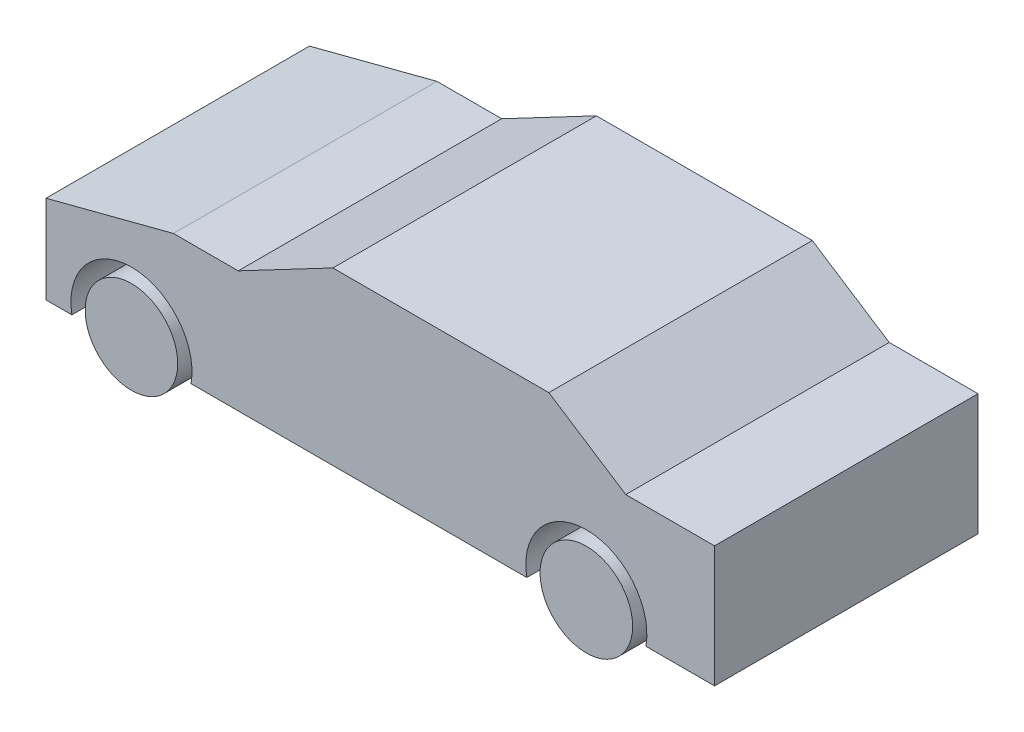
ISO-10303-21;
HEADER;
FILE_DESCRIPTION(('STEP AP214'),'2;1');
FILE_NAME('part.step','',(''),(''),'','','');
FILE_SCHEMA(('AUTOMOTIVE_DESIGN { 1 0 10303 214 1 1 1 1 }'));
ENDSEC;
DATA;
#1=APPLICATION_CONTEXT('core data for automotive mechanical design processes');
#2=APPLICATION_PROTOCOL_DEFINITION('international standard','automotive_design',2000,#1);
#3=PRODUCT_CONTEXT('',#1,'mechanical');
#4=PRODUCT('Part','Part','',(#3));
#5=PRODUCT_RELATED_PRODUCT_CATEGORY('part','',(#4));
#6=PRODUCT_DEFINITION_FORMATION('','',#4);
#7=PRODUCT_DEFINITION_CONTEXT('part definition',#1,'design');
#8=PRODUCT_DEFINITION('design','',#6,#7);
#9=PRODUCT_DEFINITION_SHAPE('','',#8);
#10=(LENGTH_UNIT() NAMED_UNIT(*) SI_UNIT(.MILLI.,.METRE.));
#11=(NAMED_UNIT(*) PLANE_ANGLE_UNIT() SI_UNIT($,.RADIAN.));
#12=(NAMED_UNIT(*) SI_UNIT($,.STERADIAN.) SOLID_ANGLE_UNIT());
#13=UNCERTAINTY_MEASURE_WITH_UNIT(LENGTH_MEASURE(1.E-05),#10,'distance_accuracy_value','');
#14=(GEOMETRIC_REPRESENTATION_CONTEXT(3) GLOBAL_UNCERTAINTY_ASSIGNED_CONTEXT((#13)) GLOBAL_UNIT_ASSIGNED_CONTEXT((#10,
#11,#12)) REPRESENTATION_CONTEXT('',''));
#15=CARTESIAN_POINT('',(0.,0.,0.));
#16=DIRECTION('',(0.,0.,1.));
#17=DIRECTION('',(1.,0.,0.));
#18=AXIS2_PLACEMENT_3D('',#15,#16,#17);
#19=CARTESIAN_POINT('',(3794.,-1118.,1850.));
#20=DIRECTION('',(0.,0.,-1.));
#21=DIRECTION('',(-1.,0.,0.));
#22=AXIS2_PLACEMENT_3D('',#19,#20,#21);
#23=CYLINDRICAL_SURFACE('',#22,325.000000000001);
#24=CARTESIAN_POINT('',(3794.,-1118.,1850.));
#25=DIRECTION('',(0.,0.,1.));
#26=DIRECTION('',(1.,0.,0.));
#27=AXIS2_PLACEMENT_3D('',#24,#25,#26);
#28=CIRCLE('',#27,325.000000000001);
#29=CARTESIAN_POINT('',(4119.,-1118.,1850.));
#30=VERTEX_POINT('',#29);
#31=EDGE_CURVE('E12',#30,#30,#28,.T.);
#32=ORIENTED_EDGE('',*,*,#31,.F.);
#33=EDGE_LOOP('',(#32));
#34=FACE_BOUND('',#33,.T.);
#35=CARTESIAN_POINT('',(3794.,-1118.,0.));
#36=DIRECTION('',(0.,0.,1.));
#37=DIRECTION('',(1.,0.,0.));
#38=AXIS2_PLACEMENT_3D('',#35,#36,#37);
#39=CIRCLE('',#38,325.000000000001);
#40=CARTESIAN_POINT('',(4119.,-1118.,0.));
#41=VERTEX_POINT('',#40);
#42=EDGE_CURVE('E135',#41,#41,#39,.T.);
#43=ORIENTED_EDGE('',*,*,#42,.T.);
#44=EDGE_LOOP('',(#43));
#45=FACE_BOUND('',#44,.T.);
#46=ADVANCED_FACE('F132',(#34,#45),#23,.T.);
#47=CARTESIAN_POINT('',(0.,0.,1850.));
#48=DIRECTION('',(0.,0.,1.));
#49=DIRECTION('',(1.,0.,0.));
#50=AXIS2_PLACEMENT_3D('',#47,#48,#49);
#51=PLANE('',#50);
#52=ORIENTED_EDGE('',*,*,#31,.T.);
#53=EDGE_LOOP('',(#52));
#54=FACE_BOUND('',#53,.T.);
#55=ADVANCED_FACE('F147',(#54),#51,.T.);
#56=CARTESIAN_POINT('',(0.,0.,0.));
#57=DIRECTION('',(0.,0.,1.));
#58=DIRECTION('',(1.,0.,0.));
#59=AXIS2_PLACEMENT_3D('',#56,#57,#58);
#60=PLANE('',#59);
#61=ORIENTED_EDGE('',*,*,#42,.F.);
#62=EDGE_LOOP('',(#61));
#63=FACE_BOUND('',#62,.T.);
#64=ADVANCED_FACE('F145',(#63),#60,.F.);
#65=CLOSED_SHELL('',(#46,#55,#64));
#66=MANIFOLD_SOLID_BREP('B2',#65);
#67=CARTESIAN_POINT('',(600.,-1118.,1850.));
#68=DIRECTION('',(0.,0.,-1.));
#69=DIRECTION('',(-1.,0.,0.));
#70=AXIS2_PLACEMENT_3D('',#67,#68,#69);
#71=CYLINDRICAL_SURFACE('',#70,325.);
#72=CARTESIAN_POINT('',(600.,-1118.,1850.));
#73=DIRECTION('',(0.,0.,1.));
#74=DIRECTION('',(1.,0.,0.));
#75=AXIS2_PLACEMENT_3D('',#72,#73,#74);
#76=CIRCLE('',#75,325.);
#77=CARTESIAN_POINT('',(925.,-1118.,1850.));
#78=VERTEX_POINT('',#77);
#79=EDGE_CURVE('E131',#78,#78,#76,.T.);
#80=ORIENTED_EDGE('',*,*,#79,.F.);
#81=EDGE_LOOP('',(#80));
#82=FACE_BOUND('',#81,.T.);
#83=CARTESIAN_POINT('',(600.,-1118.,0.));
#84=DIRECTION('',(0.,0.,1.));
#85=DIRECTION('',(1.,0.,0.));
#86=AXIS2_PLACEMENT_3D('',#83,#84,#85);
#87=CIRCLE('',#86,325.);
#88=CARTESIAN_POINT('',(925.,-1118.,0.));
#89=VERTEX_POINT('',#88);
#90=EDGE_CURVE('E185',#89,#89,#87,.T.);
#91=ORIENTED_EDGE('',*,*,#90,.T.);
#92=EDGE_LOOP('',(#91));
#93=FACE_BOUND('',#92,.T.);
#94=ADVANCED_FACE('F182',(#82,#93),#71,.T.);
#95=CARTESIAN_POINT('',(0.,0.,1850.));
#96=DIRECTION('',(0.,0.,1.));
#97=DIRECTION('',(1.,0.,0.));
#98=AXIS2_PLACEMENT_3D('',#95,#96,#97);
#99=PLANE('',#98);
#100=ORIENTED_EDGE('',*,*,#79,.T.);
#101=EDGE_LOOP('',(#100));
#102=FACE_BOUND('',#101,.T.);
#103=ADVANCED_FACE('F197',(#102),#99,.T.);
#104=CARTESIAN_POINT('',(0.,0.,0.));
#105=DIRECTION('',(0.,0.,1.));
#106=DIRECTION('',(1.,0.,0.));
#107=AXIS2_PLACEMENT_3D('',#104,#105,#106);
#108=PLANE('',#107);
#109=ORIENTED_EDGE('',*,*,#90,.F.);
#110=EDGE_LOOP('',(#109));
#111=FACE_BOUND('',#110,.T.);
#112=ADVANCED_FACE('F195',(#111),#108,.F.);
#113=CLOSED_SHELL('',(#94,#103,#112));
#114=MANIFOLD_SOLID_BREP('B7',#113);
#115=CARTESIAN_POINT('',(3794.,-1118.,1850.));
#116=DIRECTION('',(0.,0.,-1.));
#117=DIRECTION('',(-1.,0.,0.));
#118=AXIS2_PLACEMENT_3D('',#115,#116,#117);
#119=CYLINDRICAL_SURFACE('',#118,425.);
#120=CARTESIAN_POINT('',(3794.,-1118.,0.));
#121=DIRECTION('',(0.,0.,1.));
#122=DIRECTION('',(1.,0.,0.));
#123=AXIS2_PLACEMENT_3D('',#120,#121,#122);
#124=CIRCLE('',#123,425.);
#125=CARTESIAN_POINT('',(4212.33001326704,-1193.,0.));
#126=VERTEX_POINT('',#125);
#127=CARTESIAN_POINT('',(3375.66998673296,-1193.,0.));
#128=VERTEX_POINT('',#127);
#129=EDGE_CURVE('E353',#126,#128,#124,.T.);
#130=ORIENTED_EDGE('',*,*,#129,.F.);
#131=DIRECTION('',(0.,0.,-1.));
#132=VECTOR('',#131,1.);
#133=CARTESIAN_POINT('',(4212.33001326704,-1193.,1850.));
#134=LINE('',#133,#132);
#135=CARTESIAN_POINT('',(4212.33001326704,-1193.,1850.));
#136=VERTEX_POINT('',#135);
#137=EDGE_CURVE('E180',#136,#126,#134,.T.);
#138=ORIENTED_EDGE('',*,*,#137,.F.);
#139=CARTESIAN_POINT('',(3794.,-1118.,1850.));
#140=DIRECTION('',(0.,0.,1.));
#141=DIRECTION('',(1.,0.,0.));
#142=AXIS2_PLACEMENT_3D('',#139,#140,#141);
#143=CIRCLE('',#142,425.);
#144=CARTESIAN_POINT('',(3375.66998673296,-1193.,1850.));
#145=VERTEX_POINT('',#144);
#146=EDGE_CURVE('E400',#136,#145,#143,.T.);
#147=ORIENTED_EDGE('',*,*,#146,.T.);
#148=DIRECTION('',(0.,0.,-1.));
#149=VECTOR('',#148,1.);
#150=CARTESIAN_POINT('',(3375.66998673296,-1193.,1850.));
#151=LINE('',#150,#149);
#152=EDGE_CURVE('E289',#145,#128,#151,.T.);
#153=ORIENTED_EDGE('',*,*,#152,.T.);
#154=EDGE_LOOP('',(#130,#138,#147,#153));
#155=FACE_BOUND('',#154,.T.);
#156=ADVANCED_FACE('F223',(#155),#119,.F.);
#157=CARTESIAN_POINT('',(0.,-1193.,1850.));
#158=DIRECTION('',(0.,1.,0.));
#159=DIRECTION('',(0.,0.,1.));
#160=AXIS2_PLACEMENT_3D('',#157,#158,#159);
#161=PLANE('',#160);
#162=DIRECTION('',(1.,0.,0.));
#163=VECTOR('',#162,1.);
#164=CARTESIAN_POINT('',(0.,-1193.,0.));
#165=LINE('',#164,#163);
#166=CARTESIAN_POINT('',(4694.,-1193.,0.));
#167=VERTEX_POINT('',#166);
#168=EDGE_CURVE('E357',#126,#167,#165,.T.);
#169=ORIENTED_EDGE('',*,*,#168,.T.);
#170=DIRECTION('',(0.,0.,-1.));
#171=VECTOR('',#170,1.);
#172=CARTESIAN_POINT('',(4694.,-1193.,1850.));
#173=LINE('',#172,#171);
#174=CARTESIAN_POINT('',(4694.,-1193.,1850.));
#175=VERTEX_POINT('',#174);
#176=EDGE_CURVE('E232',#175,#167,#173,.T.);
#177=ORIENTED_EDGE('',*,*,#176,.F.);
#178=DIRECTION('',(1.,0.,0.));
#179=VECTOR('',#178,1.);
#180=CARTESIAN_POINT('',(0.,-1193.,1850.));
#181=LINE('',#180,#179);
#182=EDGE_CURVE('E449',#136,#175,#181,.T.);
#183=ORIENTED_EDGE('',*,*,#182,.F.);
#184=ORIENTED_EDGE('',*,*,#137,.T.);
#185=EDGE_LOOP('',(#169,#177,#183,#184));
#186=FACE_BOUND('',#185,.T.);
#187=ADVANCED_FACE('F437',(#186),#161,.F.);
#188=CARTESIAN_POINT('',(4694.,0.,1850.));
#189=DIRECTION('',(1.,0.,0.));
#190=DIRECTION('',(0.,0.,-1.));
#191=AXIS2_PLACEMENT_3D('',#188,#189,#190);
#192=PLANE('',#191);
#193=DIRECTION('',(0.,-1.,0.));
#194=VECTOR('',#193,1.);
#195=CARTESIAN_POINT('',(4694.,0.,0.));
#196=LINE('',#195,#194);
#197=CARTESIAN_POINT('',(4694.,-341.186371334687,0.));
#198=VERTEX_POINT('',#197);
#199=EDGE_CURVE('E361',#198,#167,#196,.T.);
#200=ORIENTED_EDGE('',*,*,#199,.F.);
#201=DIRECTION('',(0.,0.,-1.));
#202=VECTOR('',#201,1.);
#203=CARTESIAN_POINT('',(4694.,-341.186371334687,1850.));
#204=LINE('',#203,#202);
#205=CARTESIAN_POINT('',(4694.,-341.186371334687,1850.));
#206=VERTEX_POINT('',#205);
#207=EDGE_CURVE('E425',#206,#198,#204,.T.);
#208=ORIENTED_EDGE('',*,*,#207,.F.);
#209=DIRECTION('',(0.,-1.,0.));
#210=VECTOR('',#209,1.);
#211=CARTESIAN_POINT('',(4694.,0.,1850.));
#212=LINE('',#211,#210);
#213=EDGE_CURVE('E434',#206,#175,#212,.T.);
#214=ORIENTED_EDGE('',*,*,#213,.T.);
#215=ORIENTED_EDGE('',*,*,#176,.T.);
#216=EDGE_LOOP('',(#200,#208,#214,#215));
#217=FACE_BOUND('',#216,.T.);
#218=ADVANCED_FACE('F432',(#217),#192,.T.);
#219=CARTESIAN_POINT('',(0.,-341.186371334687,1850.));
#220=DIRECTION('',(0.,1.,0.));
#221=DIRECTION('',(0.,0.,1.));
#222=AXIS2_PLACEMENT_3D('',#219,#220,#221);
#223=PLANE('',#222);
#224=DIRECTION('',(1.,0.,0.));
#225=VECTOR('',#224,1.);
#226=CARTESIAN_POINT('',(0.,-341.186371334687,0.));
#227=LINE('',#226,#225);
#228=CARTESIAN_POINT('',(4070.67038106034,-341.186371334687,0.));
#229=VERTEX_POINT('',#228);
#230=EDGE_CURVE('E365',#229,#198,#227,.T.);
#231=ORIENTED_EDGE('',*,*,#230,.F.);
#232=DIRECTION('',(0.,0.,-1.));
#233=VECTOR('',#232,1.);
#234=CARTESIAN_POINT('',(4070.67038106034,-341.186371334687,1850.));
#235=LINE('',#234,#233);
#236=CARTESIAN_POINT('',(4070.67038106034,-341.186371334687,1850.));
#237=VERTEX_POINT('',#236);
#238=EDGE_CURVE('E422',#237,#229,#235,.T.);
#239=ORIENTED_EDGE('',*,*,#238,.F.);
#240=DIRECTION('',(1.,0.,0.));
#241=VECTOR('',#240,1.);
#242=CARTESIAN_POINT('',(0.,-341.186371334687,1850.));
#243=LINE('',#242,#241);
#244=EDGE_CURVE('E446',#237,#206,#243,.T.);
#245=ORIENTED_EDGE('',*,*,#244,.T.);
#246=ORIENTED_EDGE('',*,*,#207,.T.);
#247=EDGE_LOOP('',(#231,#239,#245,#246));
#248=FACE_BOUND('',#247,.T.);
#249=ADVANCED_FACE('F443',(#248),#223,.T.);
#250=CARTESIAN_POINT('',(1048.40561075343,1617.60741196378,1850.));
#251=DIRECTION('',(0.543879513064902,0.839163318590777,0.));
#252=DIRECTION('',(-0.839163318590777,0.543879513064902,0.));
#253=AXIS2_PLACEMENT_3D('',#250,#251,#252);
#254=PLANE('',#253);
#255=DIRECTION('',(0.839163318590777,-0.543879513064902,0.));
#256=VECTOR('',#255,1.);
#257=CARTESIAN_POINT('',(1048.40561075343,1617.60741196378,0.));
#258=LINE('',#257,#256);
#259=CARTESIAN_POINT('',(3530.64790466358,8.81362866531277,0.));
#260=VERTEX_POINT('',#259);
#261=EDGE_CURVE('E369',#260,#229,#258,.T.);
#262=ORIENTED_EDGE('',*,*,#261,.F.);
#263=DIRECTION('',(0.,0.,-1.));
#264=VECTOR('',#263,1.);
#265=CARTESIAN_POINT('',(3530.64790466358,8.81362866531277,1850.));
#266=LINE('',#265,#264);
#267=CARTESIAN_POINT('',(3530.64790466358,8.81362866531277,1850.));
#268=VERTEX_POINT('',#267);
#269=EDGE_CURVE('E419',#268,#260,#266,.T.);
#270=ORIENTED_EDGE('',*,*,#269,.F.);
#271=DIRECTION('',(0.839163318590777,-0.543879513064902,0.));
#272=VECTOR('',#271,1.);
#273=CARTESIAN_POINT('',(1048.40561075343,1617.60741196378,1850.));
#274=LINE('',#273,#272);
#275=EDGE_CURVE('E454',#268,#237,#274,.T.);
#276=ORIENTED_EDGE('',*,*,#275,.T.);
#277=ORIENTED_EDGE('',*,*,#238,.T.);
#278=EDGE_LOOP('',(#262,#270,#276,#277));
#279=FACE_BOUND('',#278,.T.);
#280=ADVANCED_FACE('F575',(#279),#254,.T.);
#281=CARTESIAN_POINT('',(0.,8.81362866531277,1850.));
#282=DIRECTION('',(0.,1.,0.));
#283=DIRECTION('',(0.,0.,1.));
#284=AXIS2_PLACEMENT_3D('',#281,#282,#283);
#285=PLANE('',#284);
#286=DIRECTION('',(1.,0.,0.));
#287=VECTOR('',#286,1.);
#288=CARTESIAN_POINT('',(0.,8.81362866531277,0.));
#289=LINE('',#288,#287);
#290=CARTESIAN_POINT('',(2014.43095170345,8.81362866531277,0.));
#291=VERTEX_POINT('',#290);
#292=EDGE_CURVE('E373',#291,#260,#289,.T.);
#293=ORIENTED_EDGE('',*,*,#292,.F.);
#294=DIRECTION('',(0.,0.,-1.));
#295=VECTOR('',#294,1.);
#296=CARTESIAN_POINT('',(2014.43095170345,8.81362866531277,1850.));
#297=LINE('',#296,#295);
#298=CARTESIAN_POINT('',(2014.43095170345,8.81362866531277,1850.));
#299=VERTEX_POINT('',#298);
#300=EDGE_CURVE('E416',#299,#291,#297,.T.);
#301=ORIENTED_EDGE('',*,*,#300,.F.);
#302=DIRECTION('',(1.,0.,0.));
#303=VECTOR('',#302,1.);
#304=CARTESIAN_POINT('',(0.,8.81362866531277,1850.));
#305=LINE('',#304,#303);
#306=EDGE_CURVE('E461',#299,#268,#305,.T.);
#307=ORIENTED_EDGE('',*,*,#306,.T.);
#308=ORIENTED_EDGE('',*,*,#269,.T.);
#309=EDGE_LOOP('',(#293,#301,#307,#308));
#310=FACE_BOUND('',#309,.T.);
#311=ADVANCED_FACE('F565',(#310),#285,.T.);
#312=CARTESIAN_POINT('',(433.703775540426,-823.594854997678,1850.));
#313=DIRECTION('',(-0.465942272843301,0.884815121015469,0.));
#314=DIRECTION('',(-0.884815121015469,-0.465942272843301,0.));
#315=AXIS2_PLACEMENT_3D('',#312,#313,#314);
#316=PLANE('',#315);
#317=DIRECTION('',(0.884815121015469,0.465942272843301,0.));
#318=VECTOR('',#317,1.);
#319=CARTESIAN_POINT('',(433.703775540426,-823.594854997678,0.));
#320=LINE('',#319,#318);
#321=CARTESIAN_POINT('',(1349.78790383051,-341.186371334687,0.));
#322=VERTEX_POINT('',#321);
#323=EDGE_CURVE('E377',#322,#291,#320,.T.);
#324=ORIENTED_EDGE('',*,*,#323,.F.);
#325=DIRECTION('',(0.,0.,-1.));
#326=VECTOR('',#325,1.);
#327=CARTESIAN_POINT('',(1349.78790383051,-341.186371334687,1850.));
#328=LINE('',#327,#326);
#329=CARTESIAN_POINT('',(1349.78790383051,-341.186371334687,1850.));
#330=VERTEX_POINT('',#329);
#331=EDGE_CURVE('E413',#330,#322,#328,.T.);
#332=ORIENTED_EDGE('',*,*,#331,.F.);
#333=DIRECTION('',(0.884815121015469,0.465942272843301,0.));
#334=VECTOR('',#333,1.);
#335=CARTESIAN_POINT('',(433.703775540426,-823.594854997678,1850.));
#336=LINE('',#335,#334);
#337=EDGE_CURVE('E465',#330,#299,#336,.T.);
#338=ORIENTED_EDGE('',*,*,#337,.T.);
#339=ORIENTED_EDGE('',*,*,#300,.T.);
#340=EDGE_LOOP('',(#324,#332,#338,#339));
#341=FACE_BOUND('',#340,.T.);
#342=ADVANCED_FACE('F556',(#341),#316,.T.);
#343=CARTESIAN_POINT('',(0.,-341.186371334687,1850.));
#344=DIRECTION('',(0.,1.,0.));
#345=DIRECTION('',(0.,0.,1.));
#346=AXIS2_PLACEMENT_3D('',#343,#344,#345);
#347=PLANE('',#346);
#348=DIRECTION('',(1.,0.,0.));
#349=VECTOR('',#348,1.);
#350=CARTESIAN_POINT('',(0.,-341.186371334687,0.));
#351=LINE('',#350,#349);
#352=CARTESIAN_POINT('',(895.308793072895,-341.186371334687,0.));
#353=VERTEX_POINT('',#352);
#354=EDGE_CURVE('E381',#353,#322,#351,.T.);
#355=ORIENTED_EDGE('',*,*,#354,.F.);
#356=DIRECTION('',(0.,0.,-1.));
#357=VECTOR('',#356,1.);
#358=CARTESIAN_POINT('',(895.308793072895,-341.186371334687,1850.));
#359=LINE('',#358,#357);
#360=CARTESIAN_POINT('',(895.308793072895,-341.186371334687,1850.));
#361=VERTEX_POINT('',#360);
#362=EDGE_CURVE('E410',#361,#353,#359,.T.);
#363=ORIENTED_EDGE('',*,*,#362,.F.);
#364=DIRECTION('',(1.,0.,0.));
#365=VECTOR('',#364,1.);
#366=CARTESIAN_POINT('',(0.,-341.186371334687,1850.));
#367=LINE('',#366,#365);
#368=EDGE_CURVE('E469',#361,#330,#367,.T.);
#369=ORIENTED_EDGE('',*,*,#368,.T.);
#370=ORIENTED_EDGE('',*,*,#331,.T.);
#371=EDGE_LOOP('',(#355,#363,#369,#370));
#372=FACE_BOUND('',#371,.T.);
#373=ADVANCED_FACE('F485',(#372),#347,.T.);
#374=CARTESIAN_POINT('',(140.038708716138,-537.838447503874,1850.));
#375=DIRECTION('',(-0.251972111424384,0.967734496163249,0.));
#376=DIRECTION('',(-0.967734496163249,-0.251972111424384,0.));
#377=AXIS2_PLACEMENT_3D('',#374,#375,#376);
#378=PLANE('',#377);
#379=DIRECTION('',(0.967734496163249,0.251972111424384,0.));
#380=VECTOR('',#379,1.);
#381=CARTESIAN_POINT('',(140.038708716138,-537.838447503874,0.));
#382=LINE('',#381,#380);
#383=CARTESIAN_POINT('',(0.,-574.30077188752,0.));
#384=VERTEX_POINT('',#383);
#385=EDGE_CURVE('E385',#384,#353,#382,.T.);
#386=ORIENTED_EDGE('',*,*,#385,.F.);
#387=DIRECTION('',(0.,0.,-1.));
#388=VECTOR('',#387,1.);
#389=CARTESIAN_POINT('',(0.,-574.30077188752,1850.));
#390=LINE('',#389,#388);
#391=CARTESIAN_POINT('',(0.,-574.30077188752,1850.));
#392=VERTEX_POINT('',#391);
#393=EDGE_CURVE('E407',#392,#384,#390,.T.);
#394=ORIENTED_EDGE('',*,*,#393,.F.);
#395=DIRECTION('',(0.967734496163249,0.251972111424384,0.));
#396=VECTOR('',#395,1.);
#397=CARTESIAN_POINT('',(140.038708716138,-537.838447503874,1850.));
#398=LINE('',#397,#396);
#399=EDGE_CURVE('E473',#392,#361,#398,.T.);
#400=ORIENTED_EDGE('',*,*,#399,.T.);
#401=ORIENTED_EDGE('',*,*,#362,.T.);
#402=EDGE_LOOP('',(#386,#394,#400,#401));
#403=FACE_BOUND('',#402,.T.);
#404=ADVANCED_FACE('F479',(#403),#378,.T.);
#405=CARTESIAN_POINT('',(0.,0.,1850.));
#406=DIRECTION('',(1.,0.,0.));
#407=DIRECTION('',(0.,1.,0.));
#408=AXIS2_PLACEMENT_3D('',#405,#406,#407);
#409=PLANE('',#408);
#410=DIRECTION('',(0.,-1.,0.));
#411=VECTOR('',#410,1.);
#412=CARTESIAN_POINT('',(0.,0.,0.));
#413=LINE('',#412,#411);
#414=CARTESIAN_POINT('',(2.80976767184496E-13,-1193.,0.));
#415=VERTEX_POINT('',#414);
#416=EDGE_CURVE('E389',#384,#415,#413,.T.);
#417=ORIENTED_EDGE('',*,*,#416,.T.);
#418=DIRECTION('',(0.,0.,-1.));
#419=VECTOR('',#418,1.);
#420=CARTESIAN_POINT('',(2.80976767184496E-13,-1193.,1850.));
#421=LINE('',#420,#419);
#422=CARTESIAN_POINT('',(2.80976767184496E-13,-1193.,1850.));
#423=VERTEX_POINT('',#422);
#424=EDGE_CURVE('E344',#423,#415,#421,.T.);
#425=ORIENTED_EDGE('',*,*,#424,.F.);
#426=DIRECTION('',(0.,-1.,0.));
#427=VECTOR('',#426,1.);
#428=CARTESIAN_POINT('',(0.,0.,1850.));
#429=LINE('',#428,#427);
#430=EDGE_CURVE('E329',#392,#423,#429,.T.);
#431=ORIENTED_EDGE('',*,*,#430,.F.);
#432=ORIENTED_EDGE('',*,*,#393,.T.);
#433=EDGE_LOOP('',(#417,#425,#431,#432));
#434=FACE_BOUND('',#433,.T.);
#435=ADVANCED_FACE('F489',(#434),#409,.F.);
#436=CARTESIAN_POINT('',(0.,-1193.,1850.));
#437=DIRECTION('',(0.,1.,0.));
#438=DIRECTION('',(0.,0.,1.));
#439=AXIS2_PLACEMENT_3D('',#436,#437,#438);
#440=PLANE('',#439);
#441=DIRECTION('',(1.,0.,0.));
#442=VECTOR('',#441,1.);
#443=CARTESIAN_POINT('',(0.,-1193.,0.));
#444=LINE('',#443,#442);
#445=CARTESIAN_POINT('',(181.669986732962,-1193.,0.));
#446=VERTEX_POINT('',#445);
#447=EDGE_CURVE('E339',#415,#446,#444,.T.);
#448=ORIENTED_EDGE('',*,*,#447,.T.);
#449=DIRECTION('',(0.,0.,-1.));
#450=VECTOR('',#449,1.);
#451=CARTESIAN_POINT('',(181.669986732962,-1193.,1850.));
#452=LINE('',#451,#450);
#453=CARTESIAN_POINT('',(181.669986732962,-1193.,1850.));
#454=VERTEX_POINT('',#453);
#455=EDGE_CURVE('E336',#454,#446,#452,.T.);
#456=ORIENTED_EDGE('',*,*,#455,.F.);
#457=DIRECTION('',(1.,0.,0.));
#458=VECTOR('',#457,1.);
#459=CARTESIAN_POINT('',(0.,-1193.,1850.));
#460=LINE('',#459,#458);
#461=EDGE_CURVE('E322',#423,#454,#460,.T.);
#462=ORIENTED_EDGE('',*,*,#461,.F.);
#463=ORIENTED_EDGE('',*,*,#424,.T.);
#464=EDGE_LOOP('',(#448,#456,#462,#463));
#465=FACE_BOUND('',#464,.T.);
#466=ADVANCED_FACE('F337',(#465),#440,.F.);
#467=CARTESIAN_POINT('',(600.,-1118.,1850.));
#468=DIRECTION('',(0.,0.,-1.));
#469=DIRECTION('',(-1.,0.,0.));
#470=AXIS2_PLACEMENT_3D('',#467,#468,#469);
#471=CYLINDRICAL_SURFACE('',#470,425.);
#472=CARTESIAN_POINT('',(600.,-1118.,0.));
#473=DIRECTION('',(0.,0.,1.));
#474=DIRECTION('',(1.,0.,0.));
#475=AXIS2_PLACEMENT_3D('',#472,#473,#474);
#476=CIRCLE('',#475,425.);
#477=CARTESIAN_POINT('',(1018.33001326704,-1193.,0.));
#478=VERTEX_POINT('',#477);
#479=EDGE_CURVE('E394',#478,#446,#476,.T.);
#480=ORIENTED_EDGE('',*,*,#479,.F.);
#481=DIRECTION('',(0.,0.,-1.));
#482=VECTOR('',#481,1.);
#483=CARTESIAN_POINT('',(1018.33001326704,-1193.,1850.));
#484=LINE('',#483,#482);
#485=CARTESIAN_POINT('',(1018.33001326704,-1193.,1850.));
#486=VERTEX_POINT('',#485);
#487=EDGE_CURVE('E282',#486,#478,#484,.T.);
#488=ORIENTED_EDGE('',*,*,#487,.F.);
#489=CARTESIAN_POINT('',(600.,-1118.,1850.));
#490=DIRECTION('',(0.,0.,1.));
#491=DIRECTION('',(1.,0.,0.));
#492=AXIS2_PLACEMENT_3D('',#489,#490,#491);
#493=CIRCLE('',#492,425.);
#494=EDGE_CURVE('E326',#486,#454,#493,.T.);
#495=ORIENTED_EDGE('',*,*,#494,.T.);
#496=ORIENTED_EDGE('',*,*,#455,.T.);
#497=EDGE_LOOP('',(#480,#488,#495,#496));
#498=FACE_BOUND('',#497,.T.);
#499=ADVANCED_FACE('F346',(#498),#471,.F.);
#500=CARTESIAN_POINT('',(0.,-1193.,1850.));
#501=DIRECTION('',(0.,1.,0.));
#502=DIRECTION('',(0.,0.,1.));
#503=AXIS2_PLACEMENT_3D('',#500,#501,#502);
#504=PLANE('',#503);
#505=DIRECTION('',(1.,0.,0.));
#506=VECTOR('',#505,1.);
#507=CARTESIAN_POINT('',(0.,-1193.,0.));
#508=LINE('',#507,#506);
#509=EDGE_CURVE('E397',#478,#128,#508,.T.);
#510=ORIENTED_EDGE('',*,*,#509,.T.);
#511=ORIENTED_EDGE('',*,*,#152,.F.);
#512=DIRECTION('',(1.,0.,0.));
#513=VECTOR('',#512,1.);
#514=CARTESIAN_POINT('',(0.,-1193.,1850.));
#515=LINE('',#514,#513);
#516=EDGE_CURVE('E240',#486,#145,#515,.T.);
#517=ORIENTED_EDGE('',*,*,#516,.F.);
#518=ORIENTED_EDGE('',*,*,#487,.T.);
#519=EDGE_LOOP('',(#510,#511,#517,#518));
#520=FACE_BOUND('',#519,.T.);
#521=ADVANCED_FACE('F502',(#520),#504,.F.);
#522=CARTESIAN_POINT('',(0.,0.,1850.));
#523=DIRECTION('',(0.,0.,1.));
#524=DIRECTION('',(1.,0.,0.));
#525=AXIS2_PLACEMENT_3D('',#522,#523,#524);
#526=PLANE('',#525);
#527=ORIENTED_EDGE('',*,*,#146,.F.);
#528=ORIENTED_EDGE('',*,*,#182,.T.);
#529=ORIENTED_EDGE('',*,*,#213,.F.);
#530=ORIENTED_EDGE('',*,*,#244,.F.);
#531=ORIENTED_EDGE('',*,*,#275,.F.);
#532=ORIENTED_EDGE('',*,*,#306,.F.);
#533=ORIENTED_EDGE('',*,*,#337,.F.);
#534=ORIENTED_EDGE('',*,*,#368,.F.);
#535=ORIENTED_EDGE('',*,*,#399,.F.);
#536=ORIENTED_EDGE('',*,*,#430,.T.);
#537=ORIENTED_EDGE('',*,*,#461,.T.);
#538=ORIENTED_EDGE('',*,*,#494,.F.);
#539=ORIENTED_EDGE('',*,*,#516,.T.);
#540=EDGE_LOOP('',(#527,#528,#529,#530,#531,#532,#533,#534,#535,#536,#537,#538,#539));
#541=FACE_BOUND('',#540,.T.);
#542=ADVANCED_FACE('F324',(#541),#526,.T.);
#543=CARTESIAN_POINT('',(0.,0.,0.));
#544=DIRECTION('',(0.,0.,1.));
#545=DIRECTION('',(1.,0.,0.));
#546=AXIS2_PLACEMENT_3D('',#543,#544,#545);
#547=PLANE('',#546);
#548=ORIENTED_EDGE('',*,*,#129,.T.);
#549=ORIENTED_EDGE('',*,*,#509,.F.);
#550=ORIENTED_EDGE('',*,*,#479,.T.);
#551=ORIENTED_EDGE('',*,*,#447,.F.);
#552=ORIENTED_EDGE('',*,*,#416,.F.);
#553=ORIENTED_EDGE('',*,*,#385,.T.);
#554=ORIENTED_EDGE('',*,*,#354,.T.);
#555=ORIENTED_EDGE('',*,*,#323,.T.);
#556=ORIENTED_EDGE('',*,*,#292,.T.);
#557=ORIENTED_EDGE('',*,*,#261,.T.);
#558=ORIENTED_EDGE('',*,*,#230,.T.);
#559=ORIENTED_EDGE('',*,*,#199,.T.);
#560=ORIENTED_EDGE('',*,*,#168,.F.);
#561=EDGE_LOOP('',(#548,#549,#550,#551,#552,#553,#554,#555,#556,#557,#558,#559,#560));
#562=FACE_BOUND('',#561,.T.);
#563=ADVANCED_FACE('F439',(#562),#547,.F.);
#564=CLOSED_SHELL('',(#156,#187,#218,#249,#280,#311,#342,#373,#404,#435,#466,#499,#521,#542,#563));
#565=MANIFOLD_SOLID_BREP('B126',#564);
#566=ADVANCED_BREP_SHAPE_REPRESENTATION('',(#18,#66,#114,#565),#14);
#567=SHAPE_DEFINITION_REPRESENTATION(#9,#566);
ENDSEC;
END-ISO-10303-21;
